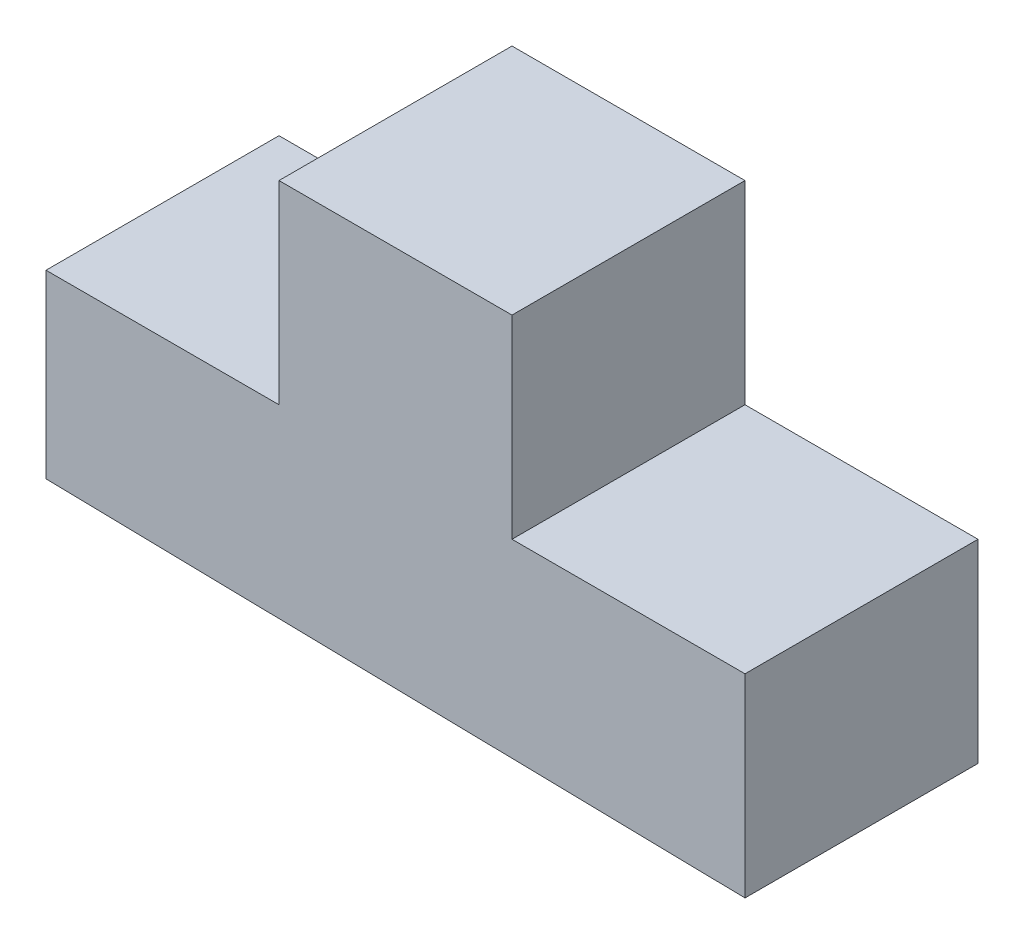
ISO-10303-21;
HEADER;
FILE_DESCRIPTION(('STEP AP214'),'2;1');
FILE_NAME('part.step','',(''),(''),'','','');
FILE_SCHEMA(('AUTOMOTIVE_DESIGN { 1 0 10303 214 1 1 1 1 }'));
ENDSEC;
DATA;
#1=APPLICATION_CONTEXT('core data for automotive mechanical design processes');
#2=APPLICATION_PROTOCOL_DEFINITION('international standard','automotive_design',2000,#1);
#3=PRODUCT_CONTEXT('',#1,'mechanical');
#4=PRODUCT('Part','Part','',(#3));
#5=PRODUCT_RELATED_PRODUCT_CATEGORY('part','',(#4));
#6=PRODUCT_DEFINITION_FORMATION('','',#4);
#7=PRODUCT_DEFINITION_CONTEXT('part definition',#1,'design');
#8=PRODUCT_DEFINITION('design','',#6,#7);
#9=PRODUCT_DEFINITION_SHAPE('','',#8);
#10=(LENGTH_UNIT() NAMED_UNIT(*) SI_UNIT(.MILLI.,.METRE.));
#11=(NAMED_UNIT(*) PLANE_ANGLE_UNIT() SI_UNIT($,.RADIAN.));
#12=(NAMED_UNIT(*) SI_UNIT($,.STERADIAN.) SOLID_ANGLE_UNIT());
#13=UNCERTAINTY_MEASURE_WITH_UNIT(LENGTH_MEASURE(1.E-05),#10,'distance_accuracy_value','');
#14=(GEOMETRIC_REPRESENTATION_CONTEXT(3) GLOBAL_UNCERTAINTY_ASSIGNED_CONTEXT((#13)) GLOBAL_UNIT_ASSIGNED_CONTEXT((#10,
#11,#12)) REPRESENTATION_CONTEXT('',''));
#15=CARTESIAN_POINT('',(0.,0.,0.));
#16=DIRECTION('',(0.,0.,1.));
#17=DIRECTION('',(1.,0.,0.));
#18=AXIS2_PLACEMENT_3D('',#15,#16,#17);
#19=CARTESIAN_POINT('',(0.,0.,30.));
#20=DIRECTION('',(1.,0.,0.));
#21=DIRECTION('',(0.,1.,0.));
#22=AXIS2_PLACEMENT_3D('',#19,#20,#21);
#23=PLANE('',#22);
#24=DIRECTION('',(0.,-1.,0.));
#25=VECTOR('',#24,1.);
#26=CARTESIAN_POINT('',(0.,0.,0.));
#27=LINE('',#26,#25);
#28=CARTESIAN_POINT('',(0.,23.2693386773547,0.));
#29=VERTEX_POINT('',#28);
#30=CARTESIAN_POINT('',(0.,0.,0.));
#31=VERTEX_POINT('',#30);
#32=EDGE_CURVE('E129',#29,#31,#27,.T.);
#33=ORIENTED_EDGE('',*,*,#32,.T.);
#34=DIRECTION('',(0.,0.,-1.));
#35=VECTOR('',#34,1.);
#36=CARTESIAN_POINT('',(0.,0.,30.));
#37=LINE('',#36,#35);
#38=CARTESIAN_POINT('',(0.,0.,30.));
#39=VERTEX_POINT('',#38);
#40=EDGE_CURVE('E11',#39,#31,#37,.T.);
#41=ORIENTED_EDGE('',*,*,#40,.F.);
#42=DIRECTION('',(0.,-1.,0.));
#43=VECTOR('',#42,1.);
#44=CARTESIAN_POINT('',(0.,0.,30.));
#45=LINE('',#44,#43);
#46=CARTESIAN_POINT('',(0.,23.2693386773547,30.));
#47=VERTEX_POINT('',#46);
#48=EDGE_CURVE('E143',#47,#39,#45,.T.);
#49=ORIENTED_EDGE('',*,*,#48,.F.);
#50=DIRECTION('',(0.,0.,-1.));
#51=VECTOR('',#50,1.);
#52=CARTESIAN_POINT('',(0.,23.2693386773547,30.));
#53=LINE('',#52,#51);
#54=EDGE_CURVE('E125',#47,#29,#53,.T.);
#55=ORIENTED_EDGE('',*,*,#54,.T.);
#56=EDGE_LOOP('',(#33,#41,#49,#55));
#57=FACE_BOUND('',#56,.T.);
#58=ADVANCED_FACE('F33',(#57),#23,.F.);
#59=CARTESIAN_POINT('',(0.,0.,30.));
#60=DIRECTION('',(0.0192260159169536,0.999815163073636,0.));
#61=DIRECTION('',(-0.999815163073636,0.0192260159169536,0.));
#62=AXIS2_PLACEMENT_3D('',#59,#60,#61);
#63=PLANE('',#62);
#64=DIRECTION('',(0.999815163073636,-0.0192260159169536,0.));
#65=VECTOR('',#64,1.);
#66=CARTESIAN_POINT('',(0.,0.,0.));
#67=LINE('',#66,#65);
#68=CARTESIAN_POINT('',(90.,-1.73066132264528,0.));
#69=VERTEX_POINT('',#68);
#70=EDGE_CURVE('E132',#31,#69,#67,.T.);
#71=ORIENTED_EDGE('',*,*,#70,.T.);
#72=DIRECTION('',(0.,0.,-1.));
#73=VECTOR('',#72,1.);
#74=CARTESIAN_POINT('',(90.,-1.73066132264528,30.));
#75=LINE('',#74,#73);
#76=CARTESIAN_POINT('',(90.,-1.73066132264528,30.));
#77=VERTEX_POINT('',#76);
#78=EDGE_CURVE('E41',#77,#69,#75,.T.);
#79=ORIENTED_EDGE('',*,*,#78,.F.);
#80=DIRECTION('',(0.999815163073636,-0.0192260159169536,0.));
#81=VECTOR('',#80,1.);
#82=CARTESIAN_POINT('',(0.,0.,30.));
#83=LINE('',#82,#81);
#84=EDGE_CURVE('E92',#39,#77,#83,.T.);
#85=ORIENTED_EDGE('',*,*,#84,.F.);
#86=ORIENTED_EDGE('',*,*,#40,.T.);
#87=EDGE_LOOP('',(#71,#79,#85,#86));
#88=FACE_BOUND('',#87,.T.);
#89=ADVANCED_FACE('F178',(#88),#63,.F.);
#90=CARTESIAN_POINT('',(90.,-1.73066132264528,30.));
#91=DIRECTION('',(-1.,0.,0.));
#92=DIRECTION('',(0.,0.,1.));
#93=AXIS2_PLACEMENT_3D('',#90,#91,#92);
#94=PLANE('',#93);
#95=DIRECTION('',(0.,1.,0.));
#96=VECTOR('',#95,1.);
#97=CARTESIAN_POINT('',(90.,-1.73066132264528,0.));
#98=LINE('',#97,#96);
#99=CARTESIAN_POINT('',(90.,23.2693386773547,0.));
#100=VERTEX_POINT('',#99);
#101=EDGE_CURVE('E134',#69,#100,#98,.T.);
#102=ORIENTED_EDGE('',*,*,#101,.T.);
#103=DIRECTION('',(0.,0.,-1.));
#104=VECTOR('',#103,1.);
#105=CARTESIAN_POINT('',(90.,23.2693386773547,30.));
#106=LINE('',#105,#104);
#107=CARTESIAN_POINT('',(90.,23.2693386773547,30.));
#108=VERTEX_POINT('',#107);
#109=EDGE_CURVE('E150',#108,#100,#106,.T.);
#110=ORIENTED_EDGE('',*,*,#109,.F.);
#111=DIRECTION('',(0.,1.,0.));
#112=VECTOR('',#111,1.);
#113=CARTESIAN_POINT('',(90.,-1.73066132264528,30.));
#114=LINE('',#113,#112);
#115=EDGE_CURVE('E158',#77,#108,#114,.T.);
#116=ORIENTED_EDGE('',*,*,#115,.F.);
#117=ORIENTED_EDGE('',*,*,#78,.T.);
#118=EDGE_LOOP('',(#102,#110,#116,#117));
#119=FACE_BOUND('',#118,.T.);
#120=ADVANCED_FACE('F156',(#119),#94,.F.);
#121=CARTESIAN_POINT('',(90.,23.2693386773547,30.));
#122=DIRECTION('',(0.,-1.,0.));
#123=DIRECTION('',(1.,0.,0.));
#124=AXIS2_PLACEMENT_3D('',#121,#122,#123);
#125=PLANE('',#124);
#126=DIRECTION('',(-1.,0.,0.));
#127=VECTOR('',#126,1.);
#128=CARTESIAN_POINT('',(90.,23.2693386773547,0.));
#129=LINE('',#128,#127);
#130=CARTESIAN_POINT('',(60.,23.2693386773547,0.));
#131=VERTEX_POINT('',#130);
#132=EDGE_CURVE('E136',#100,#131,#129,.T.);
#133=ORIENTED_EDGE('',*,*,#132,.T.);
#134=DIRECTION('',(0.,0.,-1.));
#135=VECTOR('',#134,1.);
#136=CARTESIAN_POINT('',(60.,23.2693386773547,30.));
#137=LINE('',#136,#135);
#138=CARTESIAN_POINT('',(60.,23.2693386773547,30.));
#139=VERTEX_POINT('',#138);
#140=EDGE_CURVE('E147',#139,#131,#137,.T.);
#141=ORIENTED_EDGE('',*,*,#140,.F.);
#142=DIRECTION('',(-1.,0.,0.));
#143=VECTOR('',#142,1.);
#144=CARTESIAN_POINT('',(90.,23.2693386773547,30.));
#145=LINE('',#144,#143);
#146=EDGE_CURVE('E170',#108,#139,#145,.T.);
#147=ORIENTED_EDGE('',*,*,#146,.F.);
#148=ORIENTED_EDGE('',*,*,#109,.T.);
#149=EDGE_LOOP('',(#133,#141,#147,#148));
#150=FACE_BOUND('',#149,.T.);
#151=ADVANCED_FACE('F166',(#150),#125,.F.);
#152=CARTESIAN_POINT('',(60.,23.2693386773547,30.));
#153=DIRECTION('',(-1.,0.,0.));
#154=DIRECTION('',(0.,0.,1.));
#155=AXIS2_PLACEMENT_3D('',#152,#153,#154);
#156=PLANE('',#155);
#157=DIRECTION('',(0.,1.,0.));
#158=VECTOR('',#157,1.);
#159=CARTESIAN_POINT('',(60.,23.2693386773547,0.));
#160=LINE('',#159,#158);
#161=CARTESIAN_POINT('',(60.,48.2693386773547,0.));
#162=VERTEX_POINT('',#161);
#163=EDGE_CURVE('E138',#131,#162,#160,.T.);
#164=ORIENTED_EDGE('',*,*,#163,.T.);
#165=DIRECTION('',(0.,0.,-1.));
#166=VECTOR('',#165,1.);
#167=CARTESIAN_POINT('',(60.,48.2693386773547,30.));
#168=LINE('',#167,#166);
#169=CARTESIAN_POINT('',(60.,48.2693386773547,30.));
#170=VERTEX_POINT('',#169);
#171=EDGE_CURVE('E120',#170,#162,#168,.T.);
#172=ORIENTED_EDGE('',*,*,#171,.F.);
#173=DIRECTION('',(0.,1.,0.));
#174=VECTOR('',#173,1.);
#175=CARTESIAN_POINT('',(60.,23.2693386773547,30.));
#176=LINE('',#175,#174);
#177=EDGE_CURVE('E111',#139,#170,#176,.T.);
#178=ORIENTED_EDGE('',*,*,#177,.F.);
#179=ORIENTED_EDGE('',*,*,#140,.T.);
#180=EDGE_LOOP('',(#164,#172,#178,#179));
#181=FACE_BOUND('',#180,.T.);
#182=ADVANCED_FACE('F169',(#181),#156,.F.);
#183=CARTESIAN_POINT('',(30.,48.2693386773547,30.));
#184=DIRECTION('',(0.,-1.,0.));
#185=DIRECTION('',(0.,0.,-1.));
#186=AXIS2_PLACEMENT_3D('',#183,#184,#185);
#187=PLANE('',#186);
#188=DIRECTION('',(-1.,0.,0.));
#189=VECTOR('',#188,1.);
#190=CARTESIAN_POINT('',(30.,48.2693386773547,0.));
#191=LINE('',#190,#189);
#192=CARTESIAN_POINT('',(30.,48.2693386773547,0.));
#193=VERTEX_POINT('',#192);
#194=EDGE_CURVE('E119',#162,#193,#191,.T.);
#195=ORIENTED_EDGE('',*,*,#194,.T.);
#196=DIRECTION('',(0.,0.,-1.));
#197=VECTOR('',#196,1.);
#198=CARTESIAN_POINT('',(30.,48.2693386773547,30.));
#199=LINE('',#198,#197);
#200=CARTESIAN_POINT('',(30.,48.2693386773547,30.));
#201=VERTEX_POINT('',#200);
#202=EDGE_CURVE('E116',#201,#193,#199,.T.);
#203=ORIENTED_EDGE('',*,*,#202,.F.);
#204=DIRECTION('',(-1.,0.,0.));
#205=VECTOR('',#204,1.);
#206=CARTESIAN_POINT('',(30.,48.2693386773547,30.));
#207=LINE('',#206,#205);
#208=EDGE_CURVE('E105',#170,#201,#207,.T.);
#209=ORIENTED_EDGE('',*,*,#208,.F.);
#210=ORIENTED_EDGE('',*,*,#171,.T.);
#211=EDGE_LOOP('',(#195,#203,#209,#210));
#212=FACE_BOUND('',#211,.T.);
#213=ADVANCED_FACE('F117',(#212),#187,.F.);
#214=CARTESIAN_POINT('',(30.,23.2693386773547,30.));
#215=DIRECTION('',(1.,0.,0.));
#216=DIRECTION('',(0.,0.,-1.));
#217=AXIS2_PLACEMENT_3D('',#214,#215,#216);
#218=PLANE('',#217);
#219=DIRECTION('',(0.,-1.,0.));
#220=VECTOR('',#219,1.);
#221=CARTESIAN_POINT('',(30.,23.2693386773547,0.));
#222=LINE('',#221,#220);
#223=CARTESIAN_POINT('',(30.,23.2693386773547,0.));
#224=VERTEX_POINT('',#223);
#225=EDGE_CURVE('E78',#193,#224,#222,.T.);
#226=ORIENTED_EDGE('',*,*,#225,.T.);
#227=DIRECTION('',(0.,0.,-1.));
#228=VECTOR('',#227,1.);
#229=CARTESIAN_POINT('',(30.,23.2693386773547,30.));
#230=LINE('',#229,#228);
#231=CARTESIAN_POINT('',(30.,23.2693386773547,30.));
#232=VERTEX_POINT('',#231);
#233=EDGE_CURVE('E121',#232,#224,#230,.T.);
#234=ORIENTED_EDGE('',*,*,#233,.F.);
#235=DIRECTION('',(0.,-1.,0.));
#236=VECTOR('',#235,1.);
#237=CARTESIAN_POINT('',(30.,23.2693386773547,30.));
#238=LINE('',#237,#236);
#239=EDGE_CURVE('E109',#201,#232,#238,.T.);
#240=ORIENTED_EDGE('',*,*,#239,.F.);
#241=ORIENTED_EDGE('',*,*,#202,.T.);
#242=EDGE_LOOP('',(#226,#234,#240,#241));
#243=FACE_BOUND('',#242,.T.);
#244=ADVANCED_FACE('F123',(#243),#218,.F.);
#245=CARTESIAN_POINT('',(0.,23.2693386773547,30.));
#246=DIRECTION('',(0.,-1.,0.));
#247=DIRECTION('',(0.,0.,-1.));
#248=AXIS2_PLACEMENT_3D('',#245,#246,#247);
#249=PLANE('',#248);
#250=DIRECTION('',(-1.,0.,0.));
#251=VECTOR('',#250,1.);
#252=CARTESIAN_POINT('',(0.,23.2693386773547,0.));
#253=LINE('',#252,#251);
#254=EDGE_CURVE('E84',#224,#29,#253,.T.);
#255=ORIENTED_EDGE('',*,*,#254,.T.);
#256=ORIENTED_EDGE('',*,*,#54,.F.);
#257=DIRECTION('',(-1.,0.,0.));
#258=VECTOR('',#257,1.);
#259=CARTESIAN_POINT('',(0.,23.2693386773547,30.));
#260=LINE('',#259,#258);
#261=EDGE_CURVE('E49',#232,#47,#260,.T.);
#262=ORIENTED_EDGE('',*,*,#261,.F.);
#263=ORIENTED_EDGE('',*,*,#233,.T.);
#264=EDGE_LOOP('',(#255,#256,#262,#263));
#265=FACE_BOUND('',#264,.T.);
#266=ADVANCED_FACE('F194',(#265),#249,.F.);
#267=CARTESIAN_POINT('',(0.,0.,30.));
#268=DIRECTION('',(0.,0.,-1.));
#269=DIRECTION('',(-1.,0.,0.));
#270=AXIS2_PLACEMENT_3D('',#267,#268,#269);
#271=PLANE('',#270);
#272=ORIENTED_EDGE('',*,*,#48,.T.);
#273=ORIENTED_EDGE('',*,*,#84,.T.);
#274=ORIENTED_EDGE('',*,*,#115,.T.);
#275=ORIENTED_EDGE('',*,*,#146,.T.);
#276=ORIENTED_EDGE('',*,*,#177,.T.);
#277=ORIENTED_EDGE('',*,*,#208,.T.);
#278=ORIENTED_EDGE('',*,*,#239,.T.);
#279=ORIENTED_EDGE('',*,*,#261,.T.);
#280=EDGE_LOOP('',(#272,#273,#274,#275,#276,#277,#278,#279));
#281=FACE_BOUND('',#280,.T.);
#282=ADVANCED_FACE('F107',(#281),#271,.F.);
#283=CARTESIAN_POINT('',(0.,0.,0.));
#284=DIRECTION('',(0.,0.,-1.));
#285=DIRECTION('',(-1.,0.,0.));
#286=AXIS2_PLACEMENT_3D('',#283,#284,#285);
#287=PLANE('',#286);
#288=ORIENTED_EDGE('',*,*,#32,.F.);
#289=ORIENTED_EDGE('',*,*,#254,.F.);
#290=ORIENTED_EDGE('',*,*,#225,.F.);
#291=ORIENTED_EDGE('',*,*,#194,.F.);
#292=ORIENTED_EDGE('',*,*,#163,.F.);
#293=ORIENTED_EDGE('',*,*,#132,.F.);
#294=ORIENTED_EDGE('',*,*,#101,.F.);
#295=ORIENTED_EDGE('',*,*,#70,.F.);
#296=EDGE_LOOP('',(#288,#289,#290,#291,#292,#293,#294,#295));
#297=FACE_BOUND('',#296,.T.);
#298=ADVANCED_FACE('F162',(#297),#287,.T.);
#299=CLOSED_SHELL('',(#58,#89,#120,#151,#182,#213,#244,#266,#282,#298));
#300=MANIFOLD_SOLID_BREP('B2',#299);
#301=ADVANCED_BREP_SHAPE_REPRESENTATION('',(#18,#300),#14);
#302=SHAPE_DEFINITION_REPRESENTATION(#9,#301);
ENDSEC;
END-ISO-10303-21;
